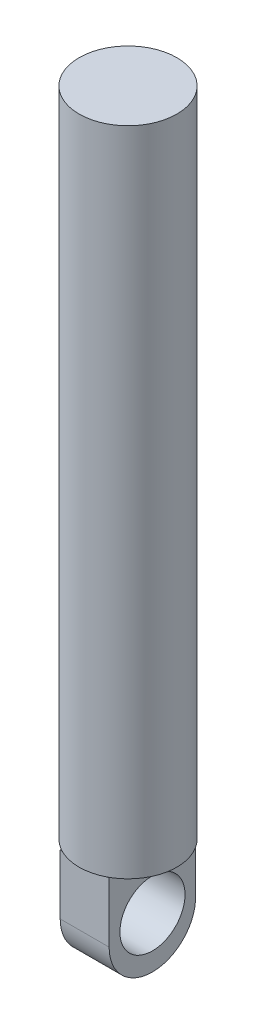
ISO-10303-21;
HEADER;
FILE_DESCRIPTION(('STEP AP214'),'2;1');
FILE_NAME('part.step','',(''),(''),'','','');
FILE_SCHEMA(('AUTOMOTIVE_DESIGN { 1 0 10303 214 1 1 1 1 }'));
ENDSEC;
DATA;
#1=APPLICATION_CONTEXT('core data for automotive mechanical design processes');
#2=APPLICATION_PROTOCOL_DEFINITION('international standard','automotive_design',2000,#1);
#3=PRODUCT_CONTEXT('',#1,'mechanical');
#4=PRODUCT('Part','Part','',(#3));
#5=PRODUCT_RELATED_PRODUCT_CATEGORY('part','',(#4));
#6=PRODUCT_DEFINITION_FORMATION('','',#4);
#7=PRODUCT_DEFINITION_CONTEXT('part definition',#1,'design');
#8=PRODUCT_DEFINITION('design','',#6,#7);
#9=PRODUCT_DEFINITION_SHAPE('','',#8);
#10=(LENGTH_UNIT() NAMED_UNIT(*) SI_UNIT(.MILLI.,.METRE.));
#11=(NAMED_UNIT(*) PLANE_ANGLE_UNIT() SI_UNIT($,.RADIAN.));
#12=(NAMED_UNIT(*) SI_UNIT($,.STERADIAN.) SOLID_ANGLE_UNIT());
#13=UNCERTAINTY_MEASURE_WITH_UNIT(LENGTH_MEASURE(1.E-05),#10,'distance_accuracy_value','');
#14=(GEOMETRIC_REPRESENTATION_CONTEXT(3) GLOBAL_UNCERTAINTY_ASSIGNED_CONTEXT((#13)) GLOBAL_UNIT_ASSIGNED_CONTEXT((#10,
#11,#12)) REPRESENTATION_CONTEXT('',''));
#15=CARTESIAN_POINT('',(0.,0.,0.));
#16=DIRECTION('',(0.,0.,1.));
#17=DIRECTION('',(1.,0.,0.));
#18=AXIS2_PLACEMENT_3D('',#15,#16,#17);
#19=CARTESIAN_POINT('',(0.,0.,0.));
#20=DIRECTION('',(0.,1.,0.));
#21=DIRECTION('',(0.,0.,1.));
#22=AXIS2_PLACEMENT_3D('',#19,#20,#21);
#23=PLANE('',#22);
#24=DIRECTION('',(0.,0.,1.));
#25=VECTOR('',#24,1.);
#26=CARTESIAN_POINT('',(7.5,0.,-13.2023159567404));
#27=LINE('',#26,#25);
#28=CARTESIAN_POINT('',(7.5,0.,-12.9785015914363));
#29=VERTEX_POINT('',#28);
#30=CARTESIAN_POINT('',(7.5,0.,12.9785015914363));
#31=VERTEX_POINT('',#30);
#32=EDGE_CURVE('E11',#29,#31,#27,.T.);
#33=ORIENTED_EDGE('',*,*,#32,.F.);
#34=CARTESIAN_POINT('',(0.,0.,0.));
#35=DIRECTION('',(0.,1.,0.));
#36=DIRECTION('',(0.,0.,1.));
#37=AXIS2_PLACEMENT_3D('',#34,#35,#36);
#38=CIRCLE('',#37,14.9897132580618);
#39=EDGE_CURVE('E182',#31,#29,#38,.T.);
#40=ORIENTED_EDGE('',*,*,#39,.F.);
#41=EDGE_LOOP('',(#33,#40));
#42=FACE_BOUND('',#41,.T.);
#43=ADVANCED_FACE('F41',(#42),#23,.F.);
#44=DIRECTION('',(1.,0.,0.));
#45=VECTOR('',#44,1.);
#46=CARTESIAN_POINT('',(-7.5,0.,-13.2023159567404));
#47=LINE('',#46,#45);
#48=CARTESIAN_POINT('',(-7.09861655094233,0.,-13.2023159567404));
#49=VERTEX_POINT('',#48);
#50=CARTESIAN_POINT('',(7.09861655094233,0.,-13.2023159567404));
#51=VERTEX_POINT('',#50);
#52=EDGE_CURVE('E51',#49,#51,#47,.T.);
#53=ORIENTED_EDGE('',*,*,#52,.F.);
#54=EDGE_CURVE('E197',#51,#49,#38,.T.);
#55=ORIENTED_EDGE('',*,*,#54,.F.);
#56=EDGE_LOOP('',(#53,#55));
#57=FACE_BOUND('',#56,.T.);
#58=ADVANCED_FACE('F213',(#57),#23,.F.);
#59=CARTESIAN_POINT('',(-7.5,0.,-12.9785015914363));
#60=VERTEX_POINT('',#59);
#61=CARTESIAN_POINT('',(-7.5,0.,12.9785015914363));
#62=VERTEX_POINT('',#61);
#63=EDGE_CURVE('E193',#60,#62,#38,.T.);
#64=ORIENTED_EDGE('',*,*,#63,.F.);
#65=DIRECTION('',(0.,0.,1.));
#66=VECTOR('',#65,1.);
#67=CARTESIAN_POINT('',(-7.5,0.,-13.2023159567404));
#68=LINE('',#67,#66);
#69=EDGE_CURVE('E133',#60,#62,#68,.T.);
#70=ORIENTED_EDGE('',*,*,#69,.T.);
#71=EDGE_LOOP('',(#64,#70));
#72=FACE_BOUND('',#71,.T.);
#73=ADVANCED_FACE('F218',(#72),#23,.F.);
#74=CARTESIAN_POINT('',(0.,200.,0.));
#75=DIRECTION('',(0.,-1.,0.));
#76=DIRECTION('',(0.,0.,-1.));
#77=AXIS2_PLACEMENT_3D('',#74,#75,#76);
#78=CYLINDRICAL_SURFACE('',#77,14.9897132580618);
#79=CARTESIAN_POINT('',(0.,200.,0.));
#80=DIRECTION('',(0.,1.,0.));
#81=DIRECTION('',(0.,0.,1.));
#82=AXIS2_PLACEMENT_3D('',#79,#80,#81);
#83=CIRCLE('',#82,14.9897132580618);
#84=CARTESIAN_POINT('',(0.,200.,14.9897132580618));
#85=VERTEX_POINT('',#84);
#86=EDGE_CURVE('E176',#85,#85,#83,.T.);
#87=ORIENTED_EDGE('',*,*,#86,.F.);
#88=EDGE_LOOP('',(#87));
#89=FACE_BOUND('',#88,.T.);
#90=CARTESIAN_POINT('',(6.92750039832329,0.,13.292901932616));
#91=VERTEX_POINT('',#90);
#92=EDGE_CURVE('E179',#91,#31,#38,.T.);
#93=ORIENTED_EDGE('',*,*,#92,.T.);
#94=ORIENTED_EDGE('',*,*,#39,.T.);
#95=EDGE_CURVE('E187',#29,#51,#38,.T.);
#96=ORIENTED_EDGE('',*,*,#95,.T.);
#97=ORIENTED_EDGE('',*,*,#54,.T.);
#98=EDGE_CURVE('E117',#49,#60,#38,.T.);
#99=ORIENTED_EDGE('',*,*,#98,.T.);
#100=ORIENTED_EDGE('',*,*,#63,.T.);
#101=CARTESIAN_POINT('',(-6.92750039832329,0.,13.292901932616));
#102=VERTEX_POINT('',#101);
#103=EDGE_CURVE('E189',#62,#102,#38,.T.);
#104=ORIENTED_EDGE('',*,*,#103,.T.);
#105=EDGE_CURVE('E169',#102,#91,#38,.T.);
#106=ORIENTED_EDGE('',*,*,#105,.T.);
#107=EDGE_LOOP('',(#93,#94,#96,#97,#99,#100,#104,#106));
#108=FACE_BOUND('',#107,.T.);
#109=ADVANCED_FACE('F43',(#89,#108),#78,.T.);
#110=CARTESIAN_POINT('',(0.,200.,0.));
#111=DIRECTION('',(0.,1.,0.));
#112=DIRECTION('',(0.,0.,1.));
#113=AXIS2_PLACEMENT_3D('',#110,#111,#112);
#114=PLANE('',#113);
#115=ORIENTED_EDGE('',*,*,#86,.T.);
#116=EDGE_LOOP('',(#115));
#117=FACE_BOUND('',#116,.T.);
#118=ADVANCED_FACE('F223',(#117),#114,.T.);
#119=ORIENTED_EDGE('',*,*,#105,.F.);
#120=DIRECTION('',(1.,0.,0.));
#121=VECTOR('',#120,1.);
#122=CARTESIAN_POINT('',(-7.5,0.,13.292901932616));
#123=LINE('',#122,#121);
#124=EDGE_CURVE('E66',#102,#91,#123,.T.);
#125=ORIENTED_EDGE('',*,*,#124,.T.);
#126=EDGE_LOOP('',(#119,#125));
#127=FACE_BOUND('',#126,.T.);
#128=ADVANCED_FACE('F214',(#127),#23,.F.);
#129=CARTESIAN_POINT('',(-7.5,0.,-13.2023159567404));
#130=DIRECTION('',(0.,1.,0.));
#131=DIRECTION('',(0.,0.,1.));
#132=AXIS2_PLACEMENT_3D('',#129,#130,#131);
#133=PLANE('',#132);
#134=ORIENTED_EDGE('',*,*,#92,.F.);
#135=CARTESIAN_POINT('',(7.5,0.,13.292901932616));
#136=VERTEX_POINT('',#135);
#137=EDGE_CURVE('E61',#91,#136,#123,.T.);
#138=ORIENTED_EDGE('',*,*,#137,.T.);
#139=EDGE_CURVE('E54',#31,#136,#27,.T.);
#140=ORIENTED_EDGE('',*,*,#139,.F.);
#141=EDGE_LOOP('',(#134,#138,#140));
#142=FACE_BOUND('',#141,.T.);
#143=ADVANCED_FACE('F222',(#142),#133,.T.);
#144=ORIENTED_EDGE('',*,*,#95,.F.);
#145=CARTESIAN_POINT('',(7.5,0.,-13.2023159567404));
#146=VERTEX_POINT('',#145);
#147=EDGE_CURVE('E53',#146,#29,#27,.T.);
#148=ORIENTED_EDGE('',*,*,#147,.F.);
#149=EDGE_CURVE('E123',#51,#146,#47,.T.);
#150=ORIENTED_EDGE('',*,*,#149,.F.);
#151=EDGE_LOOP('',(#144,#148,#150));
#152=FACE_BOUND('',#151,.T.);
#153=ADVANCED_FACE('F206',(#152),#133,.T.);
#154=ORIENTED_EDGE('',*,*,#98,.F.);
#155=CARTESIAN_POINT('',(-7.5,0.,-13.2023159567404));
#156=VERTEX_POINT('',#155);
#157=EDGE_CURVE('E111',#156,#49,#47,.T.);
#158=ORIENTED_EDGE('',*,*,#157,.F.);
#159=EDGE_CURVE('E114',#156,#60,#68,.T.);
#160=ORIENTED_EDGE('',*,*,#159,.T.);
#161=EDGE_LOOP('',(#154,#158,#160));
#162=FACE_BOUND('',#161,.T.);
#163=ADVANCED_FACE('F113',(#162),#133,.T.);
#164=ORIENTED_EDGE('',*,*,#103,.F.);
#165=CARTESIAN_POINT('',(-7.5,0.,13.292901932616));
#166=VERTEX_POINT('',#165);
#167=EDGE_CURVE('E136',#62,#166,#68,.T.);
#168=ORIENTED_EDGE('',*,*,#167,.T.);
#169=EDGE_CURVE('E173',#166,#102,#123,.T.);
#170=ORIENTED_EDGE('',*,*,#169,.T.);
#171=EDGE_LOOP('',(#164,#168,#170));
#172=FACE_BOUND('',#171,.T.);
#173=ADVANCED_FACE('F231',(#172),#133,.T.);
#174=CARTESIAN_POINT('',(-7.5,-17.6630996274281,-13.2023159567404));
#175=DIRECTION('',(0.,0.,-1.));
#176=DIRECTION('',(-1.,0.,0.));
#177=AXIS2_PLACEMENT_3D('',#174,#175,#176);
#178=PLANE('',#177);
#179=DIRECTION('',(0.,1.,0.));
#180=VECTOR('',#179,1.);
#181=CARTESIAN_POINT('',(7.5,-17.6630996274281,-13.2023159567404));
#182=LINE('',#181,#180);
#183=CARTESIAN_POINT('',(7.5,-17.6630996274281,-13.2023159567404));
#184=VERTEX_POINT('',#183);
#185=EDGE_CURVE('E158',#184,#146,#182,.T.);
#186=ORIENTED_EDGE('',*,*,#185,.F.);
#187=DIRECTION('',(1.,0.,0.));
#188=VECTOR('',#187,1.);
#189=CARTESIAN_POINT('',(-7.5,-17.6630996274281,-13.2023159567404));
#190=LINE('',#189,#188);
#191=CARTESIAN_POINT('',(-7.5,-17.6630996274281,-13.2023159567404));
#192=VERTEX_POINT('',#191);
#193=EDGE_CURVE('E140',#192,#184,#190,.T.);
#194=ORIENTED_EDGE('',*,*,#193,.F.);
#195=DIRECTION('',(0.,1.,0.));
#196=VECTOR('',#195,1.);
#197=CARTESIAN_POINT('',(-7.5,-17.6630996274281,-13.2023159567404));
#198=LINE('',#197,#196);
#199=EDGE_CURVE('E129',#192,#156,#198,.T.);
#200=ORIENTED_EDGE('',*,*,#199,.T.);
#201=ORIENTED_EDGE('',*,*,#157,.T.);
#202=ORIENTED_EDGE('',*,*,#52,.T.);
#203=ORIENTED_EDGE('',*,*,#149,.T.);
#204=EDGE_LOOP('',(#186,#194,#200,#201,#202,#203));
#205=FACE_BOUND('',#204,.T.);
#206=ADVANCED_FACE('F139',(#205),#178,.T.);
#207=CARTESIAN_POINT('',(-7.5,-18.3326538701194,0.0368329162792249));
#208=DIRECTION('',(1.,0.,0.));
#209=DIRECTION('',(0.,0.,-1.));
#210=AXIS2_PLACEMENT_3D('',#207,#208,#209);
#211=CYLINDRICAL_SURFACE('',#210,13.2560690163367);
#212=CARTESIAN_POINT('',(7.5,-18.3326538701194,0.0368329162792249));
#213=DIRECTION('',(1.,0.,0.));
#214=DIRECTION('',(0.,0.,-1.));
#215=AXIS2_PLACEMENT_3D('',#212,#213,#214);
#216=CIRCLE('',#215,13.2560690163367);
#217=CARTESIAN_POINT('',(7.5,-18.3326538701194,13.292901932616));
#218=VERTEX_POINT('',#217);
#219=EDGE_CURVE('E142',#218,#184,#216,.T.);
#220=ORIENTED_EDGE('',*,*,#219,.F.);
#221=DIRECTION('',(1.,0.,0.));
#222=VECTOR('',#221,1.);
#223=CARTESIAN_POINT('',(-7.5,-18.3326538701194,13.292901932616));
#224=LINE('',#223,#222);
#225=CARTESIAN_POINT('',(-7.5,-18.3326538701194,13.292901932616));
#226=VERTEX_POINT('',#225);
#227=EDGE_CURVE('E170',#226,#218,#224,.T.);
#228=ORIENTED_EDGE('',*,*,#227,.F.);
#229=CARTESIAN_POINT('',(-7.5,-18.3326538701194,0.0368329162792249));
#230=DIRECTION('',(1.,0.,0.));
#231=DIRECTION('',(0.,0.,-1.));
#232=AXIS2_PLACEMENT_3D('',#229,#230,#231);
#233=CIRCLE('',#232,13.2560690163367);
#234=EDGE_CURVE('E155',#226,#192,#233,.T.);
#235=ORIENTED_EDGE('',*,*,#234,.T.);
#236=ORIENTED_EDGE('',*,*,#193,.T.);
#237=EDGE_LOOP('',(#220,#228,#235,#236));
#238=FACE_BOUND('',#237,.T.);
#239=ADVANCED_FACE('F248',(#238),#211,.T.);
#240=CARTESIAN_POINT('',(-7.5,0.,13.292901932616));
#241=DIRECTION('',(0.,0.,1.));
#242=DIRECTION('',(1.,0.,0.));
#243=AXIS2_PLACEMENT_3D('',#240,#241,#242);
#244=PLANE('',#243);
#245=DIRECTION('',(0.,-1.,0.));
#246=VECTOR('',#245,1.);
#247=CARTESIAN_POINT('',(7.5,0.,13.292901932616));
#248=LINE('',#247,#246);
#249=EDGE_CURVE('E147',#136,#218,#248,.T.);
#250=ORIENTED_EDGE('',*,*,#249,.F.);
#251=ORIENTED_EDGE('',*,*,#137,.F.);
#252=ORIENTED_EDGE('',*,*,#124,.F.);
#253=ORIENTED_EDGE('',*,*,#169,.F.);
#254=DIRECTION('',(0.,-1.,0.));
#255=VECTOR('',#254,1.);
#256=CARTESIAN_POINT('',(-7.5,0.,13.292901932616));
#257=LINE('',#256,#255);
#258=EDGE_CURVE('E135',#166,#226,#257,.T.);
#259=ORIENTED_EDGE('',*,*,#258,.T.);
#260=ORIENTED_EDGE('',*,*,#227,.T.);
#261=EDGE_LOOP('',(#250,#251,#252,#253,#259,#260));
#262=FACE_BOUND('',#261,.T.);
#263=ADVANCED_FACE('F245',(#262),#244,.T.);
#264=CARTESIAN_POINT('',(-7.5,-18.3326538701194,0.0368329162792249));
#265=DIRECTION('',(1.,0.,0.));
#266=DIRECTION('',(0.,0.,-1.));
#267=AXIS2_PLACEMENT_3D('',#264,#265,#266);
#268=PLANE('',#267);
#269=CARTESIAN_POINT('',(-7.5,-15.9882790571919,0.));
#270=DIRECTION('',(1.,0.,0.));
#271=DIRECTION('',(0.,0.,-1.));
#272=AXIS2_PLACEMENT_3D('',#269,#270,#271);
#273=CIRCLE('',#272,9.98520620297953);
#274=CARTESIAN_POINT('',(-7.5,-15.9882790571919,-9.98520620297953));
#275=VERTEX_POINT('',#274);
#276=EDGE_CURVE('E150',#275,#275,#273,.T.);
#277=ORIENTED_EDGE('',*,*,#276,.T.);
#278=EDGE_LOOP('',(#277));
#279=FACE_BOUND('',#278,.T.);
#280=ORIENTED_EDGE('',*,*,#199,.F.);
#281=ORIENTED_EDGE('',*,*,#234,.F.);
#282=ORIENTED_EDGE('',*,*,#258,.F.);
#283=ORIENTED_EDGE('',*,*,#167,.F.);
#284=ORIENTED_EDGE('',*,*,#69,.F.);
#285=ORIENTED_EDGE('',*,*,#159,.F.);
#286=EDGE_LOOP('',(#280,#281,#282,#283,#284,#285));
#287=FACE_BOUND('',#286,.T.);
#288=ADVANCED_FACE('F127',(#279,#287),#268,.F.);
#289=CARTESIAN_POINT('',(7.5,-18.3326538701194,0.0368329162792249));
#290=DIRECTION('',(1.,0.,0.));
#291=DIRECTION('',(0.,0.,-1.));
#292=AXIS2_PLACEMENT_3D('',#289,#290,#291);
#293=PLANE('',#292);
#294=CARTESIAN_POINT('',(7.5,-15.9882790571919,0.));
#295=DIRECTION('',(1.,0.,0.));
#296=DIRECTION('',(0.,0.,-1.));
#297=AXIS2_PLACEMENT_3D('',#294,#295,#296);
#298=CIRCLE('',#297,9.98520620297953);
#299=CARTESIAN_POINT('',(7.5,-15.9882790571919,-9.98520620297953));
#300=VERTEX_POINT('',#299);
#301=EDGE_CURVE('E45',#300,#300,#298,.T.);
#302=ORIENTED_EDGE('',*,*,#301,.F.);
#303=EDGE_LOOP('',(#302));
#304=FACE_BOUND('',#303,.T.);
#305=ORIENTED_EDGE('',*,*,#185,.T.);
#306=ORIENTED_EDGE('',*,*,#147,.T.);
#307=ORIENTED_EDGE('',*,*,#32,.T.);
#308=ORIENTED_EDGE('',*,*,#139,.T.);
#309=ORIENTED_EDGE('',*,*,#249,.T.);
#310=ORIENTED_EDGE('',*,*,#219,.T.);
#311=EDGE_LOOP('',(#305,#306,#307,#308,#309,#310));
#312=FACE_BOUND('',#311,.T.);
#313=ADVANCED_FACE('F209',(#304,#312),#293,.T.);
#314=CARTESIAN_POINT('',(-12.5,-15.9882790571919,0.));
#315=DIRECTION('',(1.,0.,0.));
#316=DIRECTION('',(0.,0.,-1.));
#317=AXIS2_PLACEMENT_3D('',#314,#315,#316);
#318=CYLINDRICAL_SURFACE('',#317,9.98520620297953);
#319=ORIENTED_EDGE('',*,*,#301,.T.);
#320=EDGE_LOOP('',(#319));
#321=FACE_BOUND('',#320,.T.);
#322=ORIENTED_EDGE('',*,*,#276,.F.);
#323=EDGE_LOOP('',(#322));
#324=FACE_BOUND('',#323,.T.);
#325=ADVANCED_FACE('F264',(#321,#324),#318,.F.);
#326=CLOSED_SHELL('',(#43,#58,#73,#109,#118,#128,#143,#153,#163,#173,#206,#239,#263,#288,#313,#325));
#327=MANIFOLD_SOLID_BREP('B2',#326);
#328=ADVANCED_BREP_SHAPE_REPRESENTATION('',(#18,#327),#14);
#329=SHAPE_DEFINITION_REPRESENTATION(#9,#328);
ENDSEC;
END-ISO-10303-21;
